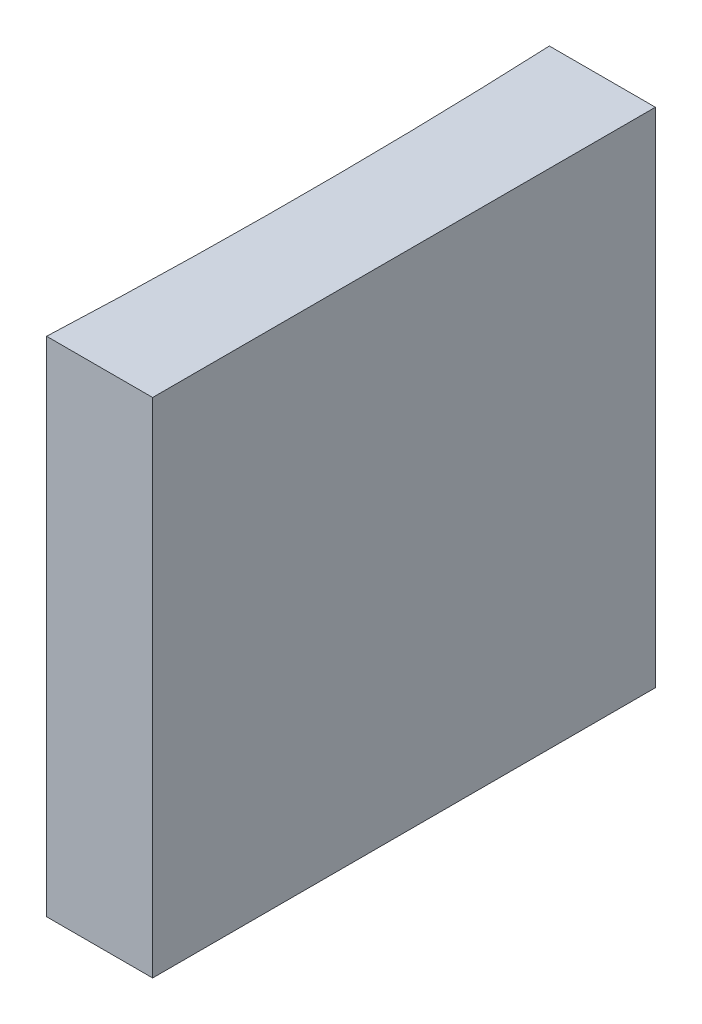
ISO-10303-21;
HEADER;
FILE_DESCRIPTION(('STEP AP214'),'2;1');
FILE_NAME('part.step','',(''),(''),'','','');
FILE_SCHEMA(('AUTOMOTIVE_DESIGN { 1 0 10303 214 1 1 1 1 }'));
ENDSEC;
DATA;
#1=APPLICATION_CONTEXT('core data for automotive mechanical design processes');
#2=APPLICATION_PROTOCOL_DEFINITION('international standard','automotive_design',2000,#1);
#3=PRODUCT_CONTEXT('',#1,'mechanical');
#4=PRODUCT('Part','Part','',(#3));
#5=PRODUCT_RELATED_PRODUCT_CATEGORY('part','',(#4));
#6=PRODUCT_DEFINITION_FORMATION('','',#4);
#7=PRODUCT_DEFINITION_CONTEXT('part definition',#1,'design');
#8=PRODUCT_DEFINITION('design','',#6,#7);
#9=PRODUCT_DEFINITION_SHAPE('','',#8);
#10=(LENGTH_UNIT() NAMED_UNIT(*) SI_UNIT(.MILLI.,.METRE.));
#11=(NAMED_UNIT(*) PLANE_ANGLE_UNIT() SI_UNIT($,.RADIAN.));
#12=(NAMED_UNIT(*) SI_UNIT($,.STERADIAN.) SOLID_ANGLE_UNIT());
#13=UNCERTAINTY_MEASURE_WITH_UNIT(LENGTH_MEASURE(1.E-05),#10,'distance_accuracy_value','');
#14=(GEOMETRIC_REPRESENTATION_CONTEXT(3) GLOBAL_UNCERTAINTY_ASSIGNED_CONTEXT((#13)) GLOBAL_UNIT_ASSIGNED_CONTEXT((#10,
#11,#12)) REPRESENTATION_CONTEXT('',''));
#15=CARTESIAN_POINT('',(0.,0.,0.));
#16=DIRECTION('',(0.,0.,1.));
#17=DIRECTION('',(1.,0.,0.));
#18=AXIS2_PLACEMENT_3D('',#15,#16,#17);
#19=CARTESIAN_POINT('',(0.,10.,0.));
#20=DIRECTION('',(0.,0.,1.));
#21=DIRECTION('',(1.,0.,0.));
#22=AXIS2_PLACEMENT_3D('',#19,#20,#21);
#23=PLANE('',#22);
#24=DIRECTION('',(-1.,0.,0.));
#25=VECTOR('',#24,1.);
#26=CARTESIAN_POINT('',(0.,0.,0.));
#27=LINE('',#26,#25);
#28=CARTESIAN_POINT('',(0.,0.,0.));
#29=VERTEX_POINT('',#28);
#30=CARTESIAN_POINT('',(-2.109107941646,0.,0.));
#31=VERTEX_POINT('',#30);
#32=EDGE_CURVE('E98',#29,#31,#27,.T.);
#33=ORIENTED_EDGE('',*,*,#32,.T.);
#34=DIRECTION('',(0.,-1.,0.));
#35=VECTOR('',#34,1.);
#36=CARTESIAN_POINT('',(-2.109107941646,10.,0.));
#37=LINE('',#36,#35);
#38=CARTESIAN_POINT('',(-2.109107941646,10.,0.));
#39=VERTEX_POINT('',#38);
#40=EDGE_CURVE('E11',#39,#31,#37,.T.);
#41=ORIENTED_EDGE('',*,*,#40,.F.);
#42=DIRECTION('',(-1.,0.,0.));
#43=VECTOR('',#42,1.);
#44=CARTESIAN_POINT('',(0.,10.,0.));
#45=LINE('',#44,#43);
#46=CARTESIAN_POINT('',(0.,10.,0.));
#47=VERTEX_POINT('',#46);
#48=EDGE_CURVE('E86',#47,#39,#45,.T.);
#49=ORIENTED_EDGE('',*,*,#48,.F.);
#50=DIRECTION('',(0.,-1.,0.));
#51=VECTOR('',#50,1.);
#52=CARTESIAN_POINT('',(0.,10.,0.));
#53=LINE('',#52,#51);
#54=EDGE_CURVE('E94',#47,#29,#53,.T.);
#55=ORIENTED_EDGE('',*,*,#54,.T.);
#56=EDGE_LOOP('',(#33,#41,#49,#55));
#57=FACE_BOUND('',#56,.T.);
#58=ADVANCED_FACE('F35',(#57),#23,.F.);
#59=CARTESIAN_POINT('',(-116.62,10.,5.00000000000001));
#60=DIRECTION('',(0.,-1.,0.));
#61=DIRECTION('',(0.,0.,-1.));
#62=AXIS2_PLACEMENT_3D('',#59,#60,#61);
#63=CYLINDRICAL_SURFACE('',#62,114.62);
#64=CARTESIAN_POINT('',(-116.62,0.,5.00000000000001));
#65=DIRECTION('',(0.,-1.,0.));
#66=DIRECTION('',(0.,0.,1.));
#67=AXIS2_PLACEMENT_3D('',#64,#65,#66);
#68=CIRCLE('',#67,114.62);
#69=CARTESIAN_POINT('',(-2.10910794164601,0.,10.));
#70=VERTEX_POINT('',#69);
#71=EDGE_CURVE('E90',#31,#70,#68,.T.);
#72=ORIENTED_EDGE('',*,*,#71,.T.);
#73=DIRECTION('',(0.,-1.,0.));
#74=VECTOR('',#73,1.);
#75=CARTESIAN_POINT('',(-2.10910794164601,10.,10.));
#76=LINE('',#75,#74);
#77=CARTESIAN_POINT('',(-2.10910794164601,10.,10.));
#78=VERTEX_POINT('',#77);
#79=EDGE_CURVE('E43',#78,#70,#76,.T.);
#80=ORIENTED_EDGE('',*,*,#79,.F.);
#81=CARTESIAN_POINT('',(-116.62,10.,5.00000000000001));
#82=DIRECTION('',(0.,-1.,0.));
#83=DIRECTION('',(0.,0.,1.));
#84=AXIS2_PLACEMENT_3D('',#81,#82,#83);
#85=CIRCLE('',#84,114.62);
#86=EDGE_CURVE('E81',#39,#78,#85,.T.);
#87=ORIENTED_EDGE('',*,*,#86,.F.);
#88=ORIENTED_EDGE('',*,*,#40,.T.);
#89=EDGE_LOOP('',(#72,#80,#87,#88));
#90=FACE_BOUND('',#89,.T.);
#91=ADVANCED_FACE('F89',(#90),#63,.F.);
#92=CARTESIAN_POINT('',(0.,10.,10.));
#93=DIRECTION('',(0.,0.,-1.));
#94=DIRECTION('',(-1.,0.,0.));
#95=AXIS2_PLACEMENT_3D('',#92,#93,#94);
#96=PLANE('',#95);
#97=DIRECTION('',(1.,0.,0.));
#98=VECTOR('',#97,1.);
#99=CARTESIAN_POINT('',(0.,0.,10.));
#100=LINE('',#99,#98);
#101=CARTESIAN_POINT('',(0.,0.,10.));
#102=VERTEX_POINT('',#101);
#103=EDGE_CURVE('E68',#70,#102,#100,.T.);
#104=ORIENTED_EDGE('',*,*,#103,.T.);
#105=DIRECTION('',(0.,-1.,0.));
#106=VECTOR('',#105,1.);
#107=CARTESIAN_POINT('',(0.,10.,10.));
#108=LINE('',#107,#106);
#109=CARTESIAN_POINT('',(0.,10.,10.));
#110=VERTEX_POINT('',#109);
#111=EDGE_CURVE('E91',#110,#102,#108,.T.);
#112=ORIENTED_EDGE('',*,*,#111,.F.);
#113=DIRECTION('',(1.,0.,0.));
#114=VECTOR('',#113,1.);
#115=CARTESIAN_POINT('',(0.,10.,10.));
#116=LINE('',#115,#114);
#117=EDGE_CURVE('E84',#78,#110,#116,.T.);
#118=ORIENTED_EDGE('',*,*,#117,.F.);
#119=ORIENTED_EDGE('',*,*,#79,.T.);
#120=EDGE_LOOP('',(#104,#112,#118,#119));
#121=FACE_BOUND('',#120,.T.);
#122=ADVANCED_FACE('F92',(#121),#96,.F.);
#123=CARTESIAN_POINT('',(0.,10.,0.));
#124=DIRECTION('',(-1.,0.,0.));
#125=DIRECTION('',(0.,0.,1.));
#126=AXIS2_PLACEMENT_3D('',#123,#124,#125);
#127=PLANE('',#126);
#128=DIRECTION('',(0.,0.,-1.));
#129=VECTOR('',#128,1.);
#130=CARTESIAN_POINT('',(0.,0.,0.));
#131=LINE('',#130,#129);
#132=EDGE_CURVE('E74',#102,#29,#131,.T.);
#133=ORIENTED_EDGE('',*,*,#132,.T.);
#134=ORIENTED_EDGE('',*,*,#54,.F.);
#135=DIRECTION('',(0.,0.,-1.));
#136=VECTOR('',#135,1.);
#137=CARTESIAN_POINT('',(0.,10.,0.));
#138=LINE('',#137,#136);
#139=EDGE_CURVE('E51',#110,#47,#138,.T.);
#140=ORIENTED_EDGE('',*,*,#139,.F.);
#141=ORIENTED_EDGE('',*,*,#111,.T.);
#142=EDGE_LOOP('',(#133,#134,#140,#141));
#143=FACE_BOUND('',#142,.T.);
#144=ADVANCED_FACE('F105',(#143),#127,.F.);
#145=CARTESIAN_POINT('',(-116.62,10.,5.00000000000001));
#146=DIRECTION('',(0.,1.,0.));
#147=DIRECTION('',(0.,0.,1.));
#148=AXIS2_PLACEMENT_3D('',#145,#146,#147);
#149=PLANE('',#148);
#150=ORIENTED_EDGE('',*,*,#48,.T.);
#151=ORIENTED_EDGE('',*,*,#86,.T.);
#152=ORIENTED_EDGE('',*,*,#117,.T.);
#153=ORIENTED_EDGE('',*,*,#139,.T.);
#154=EDGE_LOOP('',(#150,#151,#152,#153));
#155=FACE_BOUND('',#154,.T.);
#156=ADVANCED_FACE('F82',(#155),#149,.T.);
#157=CARTESIAN_POINT('',(-116.62,0.,5.00000000000001));
#158=DIRECTION('',(0.,1.,0.));
#159=DIRECTION('',(0.,0.,1.));
#160=AXIS2_PLACEMENT_3D('',#157,#158,#159);
#161=PLANE('',#160);
#162=ORIENTED_EDGE('',*,*,#32,.F.);
#163=ORIENTED_EDGE('',*,*,#132,.F.);
#164=ORIENTED_EDGE('',*,*,#103,.F.);
#165=ORIENTED_EDGE('',*,*,#71,.F.);
#166=EDGE_LOOP('',(#162,#163,#164,#165));
#167=FACE_BOUND('',#166,.T.);
#168=ADVANCED_FACE('F108',(#167),#161,.F.);
#169=CLOSED_SHELL('',(#58,#91,#122,#144,#156,#168));
#170=MANIFOLD_SOLID_BREP('B2',#169);
#171=ADVANCED_BREP_SHAPE_REPRESENTATION('',(#18,#170),#14);
#172=SHAPE_DEFINITION_REPRESENTATION(#9,#171);
ENDSEC;
END-ISO-10303-21;
